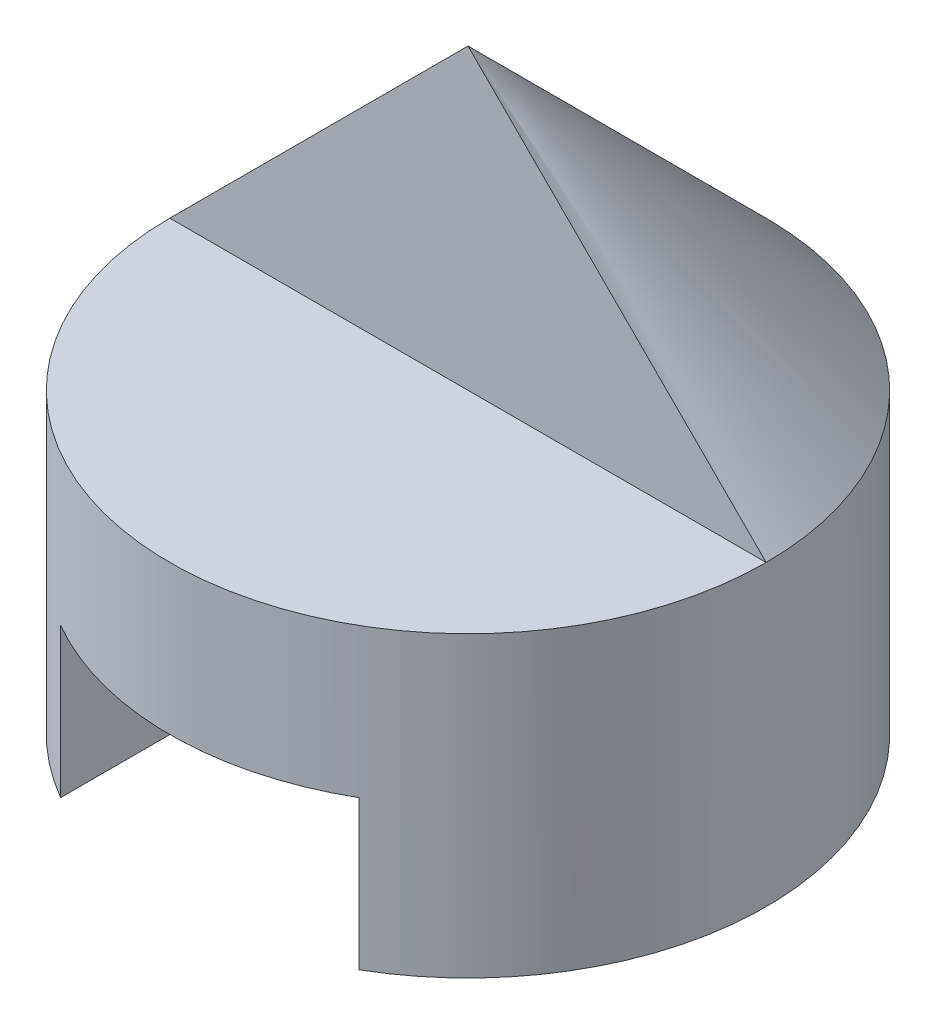
ISO-10303-21;
HEADER;
FILE_DESCRIPTION(('STEP AP214'),'2;1');
FILE_NAME('part.step','',(''),(''),'','','');
FILE_SCHEMA(('AUTOMOTIVE_DESIGN { 1 0 10303 214 1 1 1 1 }'));
ENDSEC;
DATA;
#1=APPLICATION_CONTEXT('core data for automotive mechanical design processes');
#2=APPLICATION_PROTOCOL_DEFINITION('international standard','automotive_design',2000,#1);
#3=PRODUCT_CONTEXT('',#1,'mechanical');
#4=PRODUCT('Part','Part','',(#3));
#5=PRODUCT_RELATED_PRODUCT_CATEGORY('part','',(#4));
#6=PRODUCT_DEFINITION_FORMATION('','',#4);
#7=PRODUCT_DEFINITION_CONTEXT('part definition',#1,'design');
#8=PRODUCT_DEFINITION('design','',#6,#7);
#9=PRODUCT_DEFINITION_SHAPE('','',#8);
#10=(LENGTH_UNIT() NAMED_UNIT(*) SI_UNIT(.MILLI.,.METRE.));
#11=(NAMED_UNIT(*) PLANE_ANGLE_UNIT() SI_UNIT($,.RADIAN.));
#12=(NAMED_UNIT(*) SI_UNIT($,.STERADIAN.) SOLID_ANGLE_UNIT());
#13=UNCERTAINTY_MEASURE_WITH_UNIT(LENGTH_MEASURE(1.E-05),#10,'distance_accuracy_value','');
#14=(GEOMETRIC_REPRESENTATION_CONTEXT(3) GLOBAL_UNCERTAINTY_ASSIGNED_CONTEXT((#13)) GLOBAL_UNIT_ASSIGNED_CONTEXT((#10,
#11,#12)) REPRESENTATION_CONTEXT('',''));
#15=CARTESIAN_POINT('',(0.,0.,0.));
#16=DIRECTION('',(0.,0.,1.));
#17=DIRECTION('',(1.,0.,0.));
#18=AXIS2_PLACEMENT_3D('',#15,#16,#17);
#19=CARTESIAN_POINT('',(40.,20.,0.));
#20=DIRECTION('',(0.,1.,0.));
#21=DIRECTION('',(0.,0.,1.));
#22=AXIS2_PLACEMENT_3D('',#19,#20,#21);
#23=PLANE('',#22);
#24=CARTESIAN_POINT('',(20.,20.,20.));
#25=DIRECTION('',(0.,1.,0.));
#26=DIRECTION('',(0.,0.,1.));
#27=AXIS2_PLACEMENT_3D('',#24,#25,#26);
#28=CIRCLE('',#27,20.);
#29=CARTESIAN_POINT('',(0.,20.,19.9999999999999));
#30=VERTEX_POINT('',#29);
#31=CARTESIAN_POINT('',(40.,20.,20.0000000000001));
#32=VERTEX_POINT('',#31);
#33=EDGE_CURVE('E152',#30,#32,#28,.T.);
#34=ORIENTED_EDGE('',*,*,#33,.T.);
#35=DIRECTION('',(-1.,0.,0.));
#36=VECTOR('',#35,1.);
#37=CARTESIAN_POINT('',(40.,20.,20.0000000000001));
#38=LINE('',#37,#36);
#39=EDGE_CURVE('E197',#32,#30,#38,.T.);
#40=ORIENTED_EDGE('',*,*,#39,.T.);
#41=EDGE_LOOP('',(#34,#40));
#42=FACE_BOUND('',#41,.T.);
#43=ADVANCED_FACE('F144',(#42),#23,.T.);
#44=CARTESIAN_POINT('',(20.,40.,20.));
#45=DIRECTION('',(0.,-1.,0.));
#46=DIRECTION('',(0.,0.,-1.));
#47=AXIS2_PLACEMENT_3D('',#44,#45,#46);
#48=CYLINDRICAL_SURFACE('',#47,20.);
#49=CARTESIAN_POINT('',(20.,0.,20.));
#50=DIRECTION('',(0.,1.,0.));
#51=DIRECTION('',(0.,0.,1.));
#52=AXIS2_PLACEMENT_3D('',#49,#50,#51);
#53=CIRCLE('',#52,20.);
#54=CARTESIAN_POINT('',(10.,0.,2.67949192431124));
#55=VERTEX_POINT('',#54);
#56=CARTESIAN_POINT('',(10.,0.,37.3205080756888));
#57=VERTEX_POINT('',#56);
#58=EDGE_CURVE('E215',#55,#57,#53,.T.);
#59=ORIENTED_EDGE('',*,*,#58,.T.);
#60=DIRECTION('',(0.,-1.,0.));
#61=VECTOR('',#60,1.);
#62=CARTESIAN_POINT('',(10.,40.,37.3205080756888));
#63=LINE('',#62,#61);
#64=CARTESIAN_POINT('',(10.,10.,37.3205080756888));
#65=VERTEX_POINT('',#64);
#66=EDGE_CURVE('E200',#57,#65,#63,.F.);
#67=ORIENTED_EDGE('',*,*,#66,.T.);
#68=CARTESIAN_POINT('',(20.,10.,20.));
#69=DIRECTION('',(0.,-1.,0.));
#70=DIRECTION('',(0.,0.,-1.));
#71=AXIS2_PLACEMENT_3D('',#68,#69,#70);
#72=CIRCLE('',#71,20.);
#73=CARTESIAN_POINT('',(30.,10.,37.3205080756888));
#74=VERTEX_POINT('',#73);
#75=EDGE_CURVE('E203',#65,#74,#72,.F.);
#76=ORIENTED_EDGE('',*,*,#75,.T.);
#77=DIRECTION('',(0.,-1.,0.));
#78=VECTOR('',#77,1.);
#79=CARTESIAN_POINT('',(30.,40.,37.3205080756888));
#80=LINE('',#79,#78);
#81=CARTESIAN_POINT('',(30.,0.,37.3205080756888));
#82=VERTEX_POINT('',#81);
#83=EDGE_CURVE('E208',#74,#82,#80,.T.);
#84=ORIENTED_EDGE('',*,*,#83,.T.);
#85=CARTESIAN_POINT('',(20.,0.,20.));
#86=DIRECTION('',(0.,1.,0.));
#87=DIRECTION('',(0.,0.,1.));
#88=AXIS2_PLACEMENT_3D('',#85,#86,#87);
#89=CIRCLE('',#88,20.);
#90=CARTESIAN_POINT('',(30.,0.,2.67949192431122));
#91=VERTEX_POINT('',#90);
#92=EDGE_CURVE('E211',#82,#91,#89,.T.);
#93=ORIENTED_EDGE('',*,*,#92,.T.);
#94=DIRECTION('',(0.,-1.,0.));
#95=VECTOR('',#94,1.);
#96=CARTESIAN_POINT('',(30.,40.,2.67949192431122));
#97=LINE('',#96,#95);
#98=CARTESIAN_POINT('',(30.,10.,2.67949192431122));
#99=VERTEX_POINT('',#98);
#100=EDGE_CURVE('E213',#91,#99,#97,.F.);
#101=ORIENTED_EDGE('',*,*,#100,.T.);
#102=CARTESIAN_POINT('',(20.,10.,20.));
#103=DIRECTION('',(0.,-1.,0.));
#104=DIRECTION('',(0.,0.,-1.));
#105=AXIS2_PLACEMENT_3D('',#102,#103,#104);
#106=CIRCLE('',#105,20.);
#107=CARTESIAN_POINT('',(10.,10.,2.67949192431124));
#108=VERTEX_POINT('',#107);
#109=EDGE_CURVE('E166',#99,#108,#106,.F.);
#110=ORIENTED_EDGE('',*,*,#109,.T.);
#111=DIRECTION('',(0.,-1.,0.));
#112=VECTOR('',#111,1.);
#113=CARTESIAN_POINT('',(10.,40.,2.67949192431124));
#114=LINE('',#113,#112);
#115=EDGE_CURVE('E218',#108,#55,#114,.T.);
#116=ORIENTED_EDGE('',*,*,#115,.T.);
#117=EDGE_LOOP('',(#59,#67,#76,#84,#93,#101,#110,#116));
#118=FACE_BOUND('',#117,.T.);
#119=EDGE_CURVE('E12',#32,#30,#28,.T.);
#120=ORIENTED_EDGE('',*,*,#119,.F.);
#121=ORIENTED_EDGE('',*,*,#33,.F.);
#122=EDGE_LOOP('',(#120,#121));
#123=FACE_BOUND('',#122,.T.);
#124=ADVANCED_FACE('F239',(#118,#123),#48,.T.);
#125=CARTESIAN_POINT('',(0.,0.,40.));
#126=DIRECTION('',(0.,1.,0.));
#127=DIRECTION('',(0.,0.,1.));
#128=AXIS2_PLACEMENT_3D('',#125,#126,#127);
#129=PLANE('',#128);
#130=ORIENTED_EDGE('',*,*,#92,.F.);
#131=DIRECTION('',(0.,0.,1.));
#132=VECTOR('',#131,1.);
#133=CARTESIAN_POINT('',(30.,0.,0.));
#134=LINE('',#133,#132);
#135=EDGE_CURVE('E221',#91,#82,#134,.T.);
#136=ORIENTED_EDGE('',*,*,#135,.F.);
#137=EDGE_LOOP('',(#130,#136));
#138=FACE_BOUND('',#137,.T.);
#139=ADVANCED_FACE('F146',(#138),#129,.F.);
#140=DIRECTION('',(0.,0.,1.));
#141=VECTOR('',#140,1.);
#142=CARTESIAN_POINT('',(10.,0.,0.));
#143=LINE('',#142,#141);
#144=EDGE_CURVE('E224',#55,#57,#143,.T.);
#145=ORIENTED_EDGE('',*,*,#144,.T.);
#146=ORIENTED_EDGE('',*,*,#58,.F.);
#147=EDGE_LOOP('',(#145,#146));
#148=FACE_BOUND('',#147,.T.);
#149=ADVANCED_FACE('F247',(#148),#129,.F.);
#150=CARTESIAN_POINT('',(30.,0.,0.));
#151=DIRECTION('',(-1.,0.,0.));
#152=DIRECTION('',(0.,0.,1.));
#153=AXIS2_PLACEMENT_3D('',#150,#151,#152);
#154=PLANE('',#153);
#155=ORIENTED_EDGE('',*,*,#83,.F.);
#156=DIRECTION('',(0.,0.,1.));
#157=VECTOR('',#156,1.);
#158=CARTESIAN_POINT('',(30.,10.,0.));
#159=LINE('',#158,#157);
#160=EDGE_CURVE('E220',#99,#74,#159,.T.);
#161=ORIENTED_EDGE('',*,*,#160,.F.);
#162=ORIENTED_EDGE('',*,*,#100,.F.);
#163=ORIENTED_EDGE('',*,*,#135,.T.);
#164=EDGE_LOOP('',(#155,#161,#162,#163));
#165=FACE_BOUND('',#164,.T.);
#166=ADVANCED_FACE('F237',(#165),#154,.T.);
#167=CARTESIAN_POINT('',(10.,0.,0.));
#168=DIRECTION('',(1.,0.,0.));
#169=DIRECTION('',(0.,0.,-1.));
#170=AXIS2_PLACEMENT_3D('',#167,#168,#169);
#171=PLANE('',#170);
#172=ORIENTED_EDGE('',*,*,#66,.F.);
#173=ORIENTED_EDGE('',*,*,#144,.F.);
#174=ORIENTED_EDGE('',*,*,#115,.F.);
#175=DIRECTION('',(0.,0.,1.));
#176=VECTOR('',#175,1.);
#177=CARTESIAN_POINT('',(10.,10.,0.));
#178=LINE('',#177,#176);
#179=EDGE_CURVE('E227',#108,#65,#178,.T.);
#180=ORIENTED_EDGE('',*,*,#179,.T.);
#181=EDGE_LOOP('',(#172,#173,#174,#180));
#182=FACE_BOUND('',#181,.T.);
#183=ADVANCED_FACE('F245',(#182),#171,.T.);
#184=CARTESIAN_POINT('',(0.,10.,0.));
#185=DIRECTION('',(0.,-1.,0.));
#186=DIRECTION('',(0.,0.,-1.));
#187=AXIS2_PLACEMENT_3D('',#184,#185,#186);
#188=PLANE('',#187);
#189=ORIENTED_EDGE('',*,*,#75,.F.);
#190=ORIENTED_EDGE('',*,*,#179,.F.);
#191=ORIENTED_EDGE('',*,*,#109,.F.);
#192=ORIENTED_EDGE('',*,*,#160,.T.);
#193=EDGE_LOOP('',(#189,#190,#191,#192));
#194=FACE_BOUND('',#193,.T.);
#195=ADVANCED_FACE('F232',(#194),#188,.T.);
#196=CARTESIAN_POINT('',(20.,40.,20.));
#197=DIRECTION('',(0.,-1.,0.));
#198=DIRECTION('',(0.,0.,-1.));
#199=AXIS2_PLACEMENT_3D('',#196,#197,#198);
#200=CONICAL_SURFACE('',#199,0.,0.785398163397449);
#201=DIRECTION('',(0.707106781186548,-0.707106781186547,0.));
#202=VECTOR('',#201,1.);
#203=CARTESIAN_POINT('',(20.,40.,20.));
#204=LINE('',#203,#202);
#205=CARTESIAN_POINT('',(20.,40.,20.));
#206=VERTEX_POINT('',#205);
#207=EDGE_CURVE('E193',#206,#32,#204,.T.);
#208=ORIENTED_EDGE('',*,*,#207,.T.);
#209=ORIENTED_EDGE('',*,*,#119,.T.);
#210=DIRECTION('',(-0.707106781186548,-0.707106781186547,0.));
#211=VECTOR('',#210,1.);
#212=CARTESIAN_POINT('',(20.,40.,20.));
#213=LINE('',#212,#211);
#214=EDGE_CURVE('E159',#206,#30,#213,.T.);
#215=ORIENTED_EDGE('',*,*,#214,.F.);
#216=EDGE_LOOP('',(#208,#209,#215));
#217=FACE_BOUND('',#216,.T.);
#218=ADVANCED_FACE('F192',(#217),#200,.T.);
#219=CARTESIAN_POINT('',(40.,0.,20.0000000000001));
#220=DIRECTION('',(0.,0.,-1.));
#221=DIRECTION('',(-1.,0.,0.));
#222=AXIS2_PLACEMENT_3D('',#219,#220,#221);
#223=PLANE('',#222);
#224=ORIENTED_EDGE('',*,*,#39,.F.);
#225=ORIENTED_EDGE('',*,*,#207,.F.);
#226=ORIENTED_EDGE('',*,*,#214,.T.);
#227=EDGE_LOOP('',(#224,#225,#226));
#228=FACE_BOUND('',#227,.T.);
#229=ADVANCED_FACE('F199',(#228),#223,.F.);
#230=CLOSED_SHELL('',(#43,#124,#139,#149,#166,#183,#195,#218,#229));
#231=MANIFOLD_SOLID_BREP('B2',#230);
#232=ADVANCED_BREP_SHAPE_REPRESENTATION('',(#18,#231),#14);
#233=SHAPE_DEFINITION_REPRESENTATION(#9,#232);
ENDSEC;
END-ISO-10303-21;
